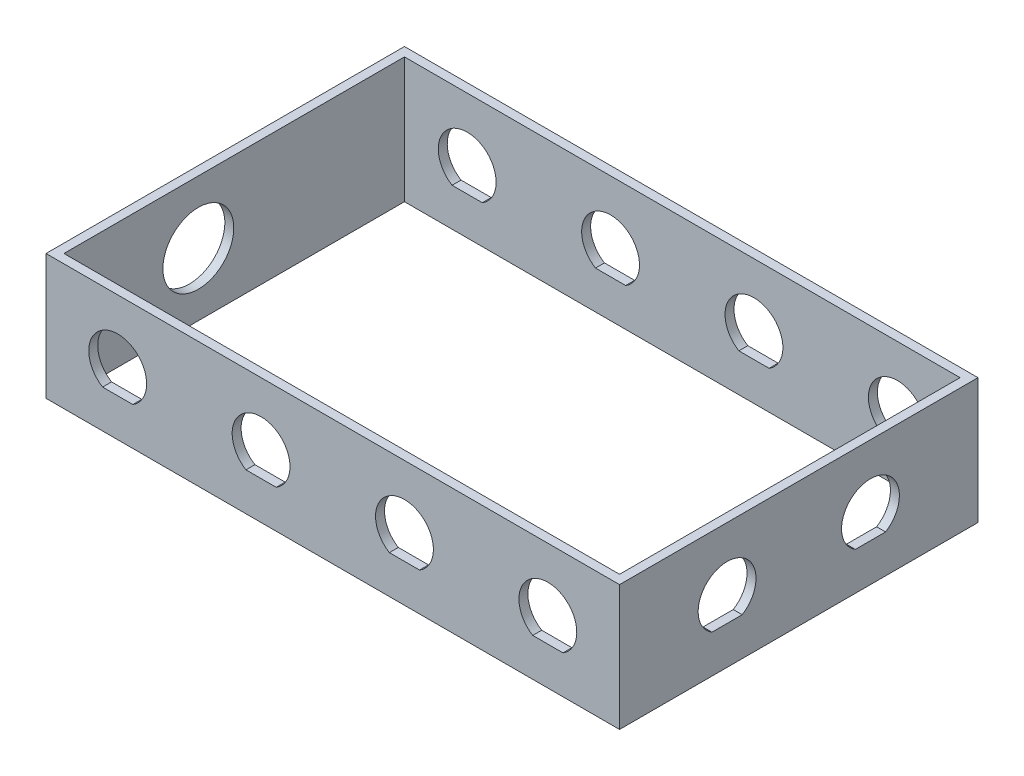
ISO-10303-21;
HEADER;
FILE_DESCRIPTION(('STEP AP214'),'2;1');
FILE_NAME('part.step','',(''),(''),'','','');
FILE_SCHEMA(('AUTOMOTIVE_DESIGN { 1 0 10303 214 1 1 1 1 }'));
ENDSEC;
DATA;
#1=APPLICATION_CONTEXT('core data for automotive mechanical design processes');
#2=APPLICATION_PROTOCOL_DEFINITION('international standard','automotive_design',2000,#1);
#3=PRODUCT_CONTEXT('',#1,'mechanical');
#4=PRODUCT('Part','Part','',(#3));
#5=PRODUCT_RELATED_PRODUCT_CATEGORY('part','',(#4));
#6=PRODUCT_DEFINITION_FORMATION('','',#4);
#7=PRODUCT_DEFINITION_CONTEXT('part definition',#1,'design');
#8=PRODUCT_DEFINITION('design','',#6,#7);
#9=PRODUCT_DEFINITION_SHAPE('','',#8);
#10=(LENGTH_UNIT() NAMED_UNIT(*) SI_UNIT(.MILLI.,.METRE.));
#11=(NAMED_UNIT(*) PLANE_ANGLE_UNIT() SI_UNIT($,.RADIAN.));
#12=(NAMED_UNIT(*) SI_UNIT($,.STERADIAN.) SOLID_ANGLE_UNIT());
#13=UNCERTAINTY_MEASURE_WITH_UNIT(LENGTH_MEASURE(1.E-05),#10,'distance_accuracy_value','');
#14=(GEOMETRIC_REPRESENTATION_CONTEXT(3) GLOBAL_UNCERTAINTY_ASSIGNED_CONTEXT((#13)) GLOBAL_UNIT_ASSIGNED_CONTEXT((#10,
#11,#12)) REPRESENTATION_CONTEXT('',''));
#15=CARTESIAN_POINT('',(0.,0.,0.));
#16=DIRECTION('',(0.,0.,1.));
#17=DIRECTION('',(1.,0.,0.));
#18=AXIS2_PLACEMENT_3D('',#15,#16,#17);
#19=CARTESIAN_POINT('',(-101.6,44.45,63.5));
#20=DIRECTION('',(1.,0.,0.));
#21=DIRECTION('',(0.,0.,-1.));
#22=AXIS2_PLACEMENT_3D('',#19,#20,#21);
#23=PLANE('',#22);
#24=CARTESIAN_POINT('',(-101.6,22.225,12.7));
#25=DIRECTION('',(-1.,0.,0.));
#26=DIRECTION('',(0.,0.,1.));
#27=AXIS2_PLACEMENT_3D('',#24,#25,#26);
#28=CIRCLE('',#27,12.55395);
#29=CARTESIAN_POINT('',(-101.6,22.225,25.25395));
#30=VERTEX_POINT('',#29);
#31=EDGE_CURVE('E234',#30,#30,#28,.T.);
#32=ORIENTED_EDGE('',*,*,#31,.F.);
#33=EDGE_LOOP('',(#32));
#34=FACE_BOUND('',#33,.T.);
#35=DIRECTION('',(0.,-1.,0.));
#36=VECTOR('',#35,1.);
#37=CARTESIAN_POINT('',(-101.6,44.45,-63.5));
#38=LINE('',#37,#36);
#39=CARTESIAN_POINT('',(-101.6,44.45,-63.5));
#40=VERTEX_POINT('',#39);
#41=CARTESIAN_POINT('',(-101.6,0.,-63.5));
#42=VERTEX_POINT('',#41);
#43=EDGE_CURVE('E393',#40,#42,#38,.T.);
#44=ORIENTED_EDGE('',*,*,#43,.T.);
#45=DIRECTION('',(0.,0.,1.));
#46=VECTOR('',#45,1.);
#47=CARTESIAN_POINT('',(-101.6,0.,63.5));
#48=LINE('',#47,#46);
#49=CARTESIAN_POINT('',(-101.6,0.,63.5));
#50=VERTEX_POINT('',#49);
#51=EDGE_CURVE('E377',#42,#50,#48,.T.);
#52=ORIENTED_EDGE('',*,*,#51,.T.);
#53=DIRECTION('',(0.,-1.,0.));
#54=VECTOR('',#53,1.);
#55=CARTESIAN_POINT('',(-101.6,44.45,63.5));
#56=LINE('',#55,#54);
#57=CARTESIAN_POINT('',(-101.6,44.45,63.5));
#58=VERTEX_POINT('',#57);
#59=EDGE_CURVE('E409',#58,#50,#56,.T.);
#60=ORIENTED_EDGE('',*,*,#59,.F.);
#61=DIRECTION('',(0.,0.,1.));
#62=VECTOR('',#61,1.);
#63=CARTESIAN_POINT('',(-101.6,44.45,63.5));
#64=LINE('',#63,#62);
#65=EDGE_CURVE('E383',#40,#58,#64,.T.);
#66=ORIENTED_EDGE('',*,*,#65,.F.);
#67=EDGE_LOOP('',(#44,#52,#60,#66));
#68=FACE_BOUND('',#67,.T.);
#69=ADVANCED_FACE('F33',(#34,#68),#23,.F.);
#70=CARTESIAN_POINT('',(101.6,44.45,63.5));
#71=DIRECTION('',(0.,0.,-1.));
#72=DIRECTION('',(-1.,0.,0.));
#73=AXIS2_PLACEMENT_3D('',#70,#71,#72);
#74=PLANE('',#73);
#75=CARTESIAN_POINT('',(76.2,22.225,63.5));
#76=DIRECTION('',(0.,0.,1.));
#77=DIRECTION('',(1.,0.,0.));
#78=AXIS2_PLACEMENT_3D('',#75,#76,#77);
#79=CIRCLE('',#78,10.2489);
#80=CARTESIAN_POINT('',(81.5567058394129,13.4874,63.5));
#81=VERTEX_POINT('',#80);
#82=CARTESIAN_POINT('',(70.8432941605871,13.4874,63.5));
#83=VERTEX_POINT('',#82);
#84=EDGE_CURVE('E259',#81,#83,#79,.T.);
#85=ORIENTED_EDGE('',*,*,#84,.F.);
#86=DIRECTION('',(1.,0.,0.));
#87=VECTOR('',#86,1.);
#88=CARTESIAN_POINT('',(0.,13.4874,63.5));
#89=LINE('',#88,#87);
#90=EDGE_CURVE('E254',#83,#81,#89,.T.);
#91=ORIENTED_EDGE('',*,*,#90,.F.);
#92=EDGE_LOOP('',(#85,#91));
#93=FACE_BOUND('',#92,.T.);
#94=CARTESIAN_POINT('',(25.4,22.225,63.5));
#95=DIRECTION('',(0.,0.,1.));
#96=DIRECTION('',(1.,0.,0.));
#97=AXIS2_PLACEMENT_3D('',#94,#95,#96);
#98=CIRCLE('',#97,10.2489);
#99=CARTESIAN_POINT('',(30.7567058394129,13.4874,63.5));
#100=VERTEX_POINT('',#99);
#101=CARTESIAN_POINT('',(20.0432941605871,13.4874,63.5));
#102=VERTEX_POINT('',#101);
#103=EDGE_CURVE('E283',#100,#102,#98,.T.);
#104=ORIENTED_EDGE('',*,*,#103,.F.);
#105=DIRECTION('',(1.,0.,0.));
#106=VECTOR('',#105,1.);
#107=CARTESIAN_POINT('',(0.,13.4874,63.5));
#108=LINE('',#107,#106);
#109=EDGE_CURVE('E278',#102,#100,#108,.T.);
#110=ORIENTED_EDGE('',*,*,#109,.F.);
#111=EDGE_LOOP('',(#104,#110));
#112=FACE_BOUND('',#111,.T.);
#113=CARTESIAN_POINT('',(-25.4,22.225,63.5));
#114=DIRECTION('',(0.,0.,1.));
#115=DIRECTION('',(1.,0.,0.));
#116=AXIS2_PLACEMENT_3D('',#113,#114,#115);
#117=CIRCLE('',#116,10.2489);
#118=CARTESIAN_POINT('',(-20.0432941605871,13.4874,63.5));
#119=VERTEX_POINT('',#118);
#120=CARTESIAN_POINT('',(-30.7567058394129,13.4874,63.5));
#121=VERTEX_POINT('',#120);
#122=EDGE_CURVE('E307',#119,#121,#117,.T.);
#123=ORIENTED_EDGE('',*,*,#122,.F.);
#124=DIRECTION('',(1.,0.,0.));
#125=VECTOR('',#124,1.);
#126=CARTESIAN_POINT('',(0.,13.4874,63.5));
#127=LINE('',#126,#125);
#128=EDGE_CURVE('E302',#121,#119,#127,.T.);
#129=ORIENTED_EDGE('',*,*,#128,.F.);
#130=EDGE_LOOP('',(#123,#129));
#131=FACE_BOUND('',#130,.T.);
#132=CARTESIAN_POINT('',(-76.2,22.225,63.5));
#133=DIRECTION('',(0.,0.,1.));
#134=DIRECTION('',(1.,0.,0.));
#135=AXIS2_PLACEMENT_3D('',#132,#133,#134);
#136=CIRCLE('',#135,10.2489);
#137=CARTESIAN_POINT('',(-70.8432941605871,13.4874,63.5));
#138=VERTEX_POINT('',#137);
#139=CARTESIAN_POINT('',(-81.5567058394129,13.4874,63.5));
#140=VERTEX_POINT('',#139);
#141=EDGE_CURVE('E331',#138,#140,#136,.T.);
#142=ORIENTED_EDGE('',*,*,#141,.F.);
#143=DIRECTION('',(1.,0.,0.));
#144=VECTOR('',#143,1.);
#145=CARTESIAN_POINT('',(0.,13.4874,63.5));
#146=LINE('',#145,#144);
#147=EDGE_CURVE('E326',#140,#138,#146,.T.);
#148=ORIENTED_EDGE('',*,*,#147,.F.);
#149=EDGE_LOOP('',(#142,#148));
#150=FACE_BOUND('',#149,.T.);
#151=ORIENTED_EDGE('',*,*,#59,.T.);
#152=DIRECTION('',(1.,0.,0.));
#153=VECTOR('',#152,1.);
#154=CARTESIAN_POINT('',(101.6,0.,63.5));
#155=LINE('',#154,#153);
#156=CARTESIAN_POINT('',(101.6,0.,63.5));
#157=VERTEX_POINT('',#156);
#158=EDGE_CURVE('E396',#50,#157,#155,.T.);
#159=ORIENTED_EDGE('',*,*,#158,.T.);
#160=DIRECTION('',(0.,-1.,0.));
#161=VECTOR('',#160,1.);
#162=CARTESIAN_POINT('',(101.6,44.45,63.5));
#163=LINE('',#162,#161);
#164=CARTESIAN_POINT('',(101.6,44.45,63.5));
#165=VERTEX_POINT('',#164);
#166=EDGE_CURVE('E407',#165,#157,#163,.T.);
#167=ORIENTED_EDGE('',*,*,#166,.F.);
#168=DIRECTION('',(1.,0.,0.));
#169=VECTOR('',#168,1.);
#170=CARTESIAN_POINT('',(101.6,44.45,63.5));
#171=LINE('',#170,#169);
#172=EDGE_CURVE('E386',#58,#165,#171,.T.);
#173=ORIENTED_EDGE('',*,*,#172,.F.);
#174=EDGE_LOOP('',(#151,#159,#167,#173));
#175=FACE_BOUND('',#174,.T.);
#176=ADVANCED_FACE('F442',(#93,#112,#131,#150,#175),#74,.F.);
#177=CARTESIAN_POINT('',(101.6,44.45,63.5));
#178=DIRECTION('',(-1.,0.,0.));
#179=DIRECTION('',(0.,0.,1.));
#180=AXIS2_PLACEMENT_3D('',#177,#178,#179);
#181=PLANE('',#180);
#182=DIRECTION('',(0.,0.,-1.));
#183=VECTOR('',#182,1.);
#184=CARTESIAN_POINT('',(101.6,13.4874,0.));
#185=LINE('',#184,#183);
#186=CARTESIAN_POINT('',(101.6,13.4874,-20.0432941605871));
#187=VERTEX_POINT('',#186);
#188=CARTESIAN_POINT('',(101.6,13.4874,-30.7567058394129));
#189=VERTEX_POINT('',#188);
#190=EDGE_CURVE('E220',#187,#189,#185,.T.);
#191=ORIENTED_EDGE('',*,*,#190,.F.);
#192=CARTESIAN_POINT('',(101.6,22.225,-25.4));
#193=DIRECTION('',(1.,0.,0.));
#194=DIRECTION('',(0.,0.,-1.));
#195=AXIS2_PLACEMENT_3D('',#192,#193,#194);
#196=CIRCLE('',#195,10.2489);
#197=EDGE_CURVE('E47',#189,#187,#196,.T.);
#198=ORIENTED_EDGE('',*,*,#197,.F.);
#199=EDGE_LOOP('',(#191,#198));
#200=FACE_BOUND('',#199,.T.);
#201=DIRECTION('',(0.,0.,-1.));
#202=VECTOR('',#201,1.);
#203=CARTESIAN_POINT('',(101.6,13.4874,0.));
#204=LINE('',#203,#202);
#205=CARTESIAN_POINT('',(101.6,13.4874,30.7567058394129));
#206=VERTEX_POINT('',#205);
#207=CARTESIAN_POINT('',(101.6,13.4874,20.0432941605871));
#208=VERTEX_POINT('',#207);
#209=EDGE_CURVE('E243',#206,#208,#204,.T.);
#210=ORIENTED_EDGE('',*,*,#209,.F.);
#211=CARTESIAN_POINT('',(101.6,22.225,25.4));
#212=DIRECTION('',(1.,0.,0.));
#213=DIRECTION('',(0.,0.,-1.));
#214=AXIS2_PLACEMENT_3D('',#211,#212,#213);
#215=CIRCLE('',#214,10.2489);
#216=EDGE_CURVE('E241',#208,#206,#215,.T.);
#217=ORIENTED_EDGE('',*,*,#216,.F.);
#218=EDGE_LOOP('',(#210,#217));
#219=FACE_BOUND('',#218,.T.);
#220=ORIENTED_EDGE('',*,*,#166,.T.);
#221=DIRECTION('',(0.,0.,-1.));
#222=VECTOR('',#221,1.);
#223=CARTESIAN_POINT('',(101.6,0.,63.5));
#224=LINE('',#223,#222);
#225=CARTESIAN_POINT('',(101.6,0.,-63.5));
#226=VERTEX_POINT('',#225);
#227=EDGE_CURVE('E399',#157,#226,#224,.T.);
#228=ORIENTED_EDGE('',*,*,#227,.T.);
#229=DIRECTION('',(0.,-1.,0.));
#230=VECTOR('',#229,1.);
#231=CARTESIAN_POINT('',(101.6,44.45,-63.5));
#232=LINE('',#231,#230);
#233=CARTESIAN_POINT('',(101.6,44.45,-63.5));
#234=VERTEX_POINT('',#233);
#235=EDGE_CURVE('E405',#234,#226,#232,.T.);
#236=ORIENTED_EDGE('',*,*,#235,.F.);
#237=DIRECTION('',(0.,0.,-1.));
#238=VECTOR('',#237,1.);
#239=CARTESIAN_POINT('',(101.6,44.45,63.5));
#240=LINE('',#239,#238);
#241=EDGE_CURVE('E389',#165,#234,#240,.T.);
#242=ORIENTED_EDGE('',*,*,#241,.F.);
#243=EDGE_LOOP('',(#220,#228,#236,#242));
#244=FACE_BOUND('',#243,.T.);
#245=ADVANCED_FACE('F445',(#200,#219,#244),#181,.F.);
#246=CARTESIAN_POINT('',(101.6,44.45,-63.5));
#247=DIRECTION('',(0.,0.,1.));
#248=DIRECTION('',(1.,0.,0.));
#249=AXIS2_PLACEMENT_3D('',#246,#247,#248);
#250=PLANE('',#249);
#251=CARTESIAN_POINT('',(76.2,22.225,-63.5));
#252=DIRECTION('',(0.,0.,1.));
#253=DIRECTION('',(1.,0.,0.));
#254=AXIS2_PLACEMENT_3D('',#251,#252,#253);
#255=CIRCLE('',#254,10.2489);
#256=CARTESIAN_POINT('',(81.5567058394129,13.4874,-63.5));
#257=VERTEX_POINT('',#256);
#258=CARTESIAN_POINT('',(70.8432941605871,13.4874,-63.5));
#259=VERTEX_POINT('',#258);
#260=EDGE_CURVE('E258',#257,#259,#255,.T.);
#261=ORIENTED_EDGE('',*,*,#260,.T.);
#262=DIRECTION('',(1.,0.,0.));
#263=VECTOR('',#262,1.);
#264=CARTESIAN_POINT('',(0.,13.4874,-63.5));
#265=LINE('',#264,#263);
#266=EDGE_CURVE('E255',#259,#257,#265,.T.);
#267=ORIENTED_EDGE('',*,*,#266,.T.);
#268=EDGE_LOOP('',(#261,#267));
#269=FACE_BOUND('',#268,.T.);
#270=CARTESIAN_POINT('',(25.4,22.225,-63.5));
#271=DIRECTION('',(0.,0.,1.));
#272=DIRECTION('',(1.,0.,0.));
#273=AXIS2_PLACEMENT_3D('',#270,#271,#272);
#274=CIRCLE('',#273,10.2489);
#275=CARTESIAN_POINT('',(30.7567058394129,13.4874,-63.5));
#276=VERTEX_POINT('',#275);
#277=CARTESIAN_POINT('',(20.0432941605871,13.4874,-63.5));
#278=VERTEX_POINT('',#277);
#279=EDGE_CURVE('E282',#276,#278,#274,.T.);
#280=ORIENTED_EDGE('',*,*,#279,.T.);
#281=DIRECTION('',(1.,0.,0.));
#282=VECTOR('',#281,1.);
#283=CARTESIAN_POINT('',(0.,13.4874,-63.5));
#284=LINE('',#283,#282);
#285=EDGE_CURVE('E279',#278,#276,#284,.T.);
#286=ORIENTED_EDGE('',*,*,#285,.T.);
#287=EDGE_LOOP('',(#280,#286));
#288=FACE_BOUND('',#287,.T.);
#289=CARTESIAN_POINT('',(-25.4,22.225,-63.5));
#290=DIRECTION('',(0.,0.,1.));
#291=DIRECTION('',(1.,0.,0.));
#292=AXIS2_PLACEMENT_3D('',#289,#290,#291);
#293=CIRCLE('',#292,10.2489);
#294=CARTESIAN_POINT('',(-20.0432941605871,13.4874,-63.5));
#295=VERTEX_POINT('',#294);
#296=CARTESIAN_POINT('',(-30.7567058394129,13.4874,-63.5));
#297=VERTEX_POINT('',#296);
#298=EDGE_CURVE('E306',#295,#297,#293,.T.);
#299=ORIENTED_EDGE('',*,*,#298,.T.);
#300=DIRECTION('',(1.,0.,0.));
#301=VECTOR('',#300,1.);
#302=CARTESIAN_POINT('',(0.,13.4874,-63.5));
#303=LINE('',#302,#301);
#304=EDGE_CURVE('E303',#297,#295,#303,.T.);
#305=ORIENTED_EDGE('',*,*,#304,.T.);
#306=EDGE_LOOP('',(#299,#305));
#307=FACE_BOUND('',#306,.T.);
#308=CARTESIAN_POINT('',(-76.2,22.225,-63.5));
#309=DIRECTION('',(0.,0.,1.));
#310=DIRECTION('',(1.,0.,0.));
#311=AXIS2_PLACEMENT_3D('',#308,#309,#310);
#312=CIRCLE('',#311,10.2489);
#313=CARTESIAN_POINT('',(-70.8432941605871,13.4874,-63.5));
#314=VERTEX_POINT('',#313);
#315=CARTESIAN_POINT('',(-81.5567058394129,13.4874,-63.5));
#316=VERTEX_POINT('',#315);
#317=EDGE_CURVE('E330',#314,#316,#312,.T.);
#318=ORIENTED_EDGE('',*,*,#317,.T.);
#319=DIRECTION('',(1.,0.,0.));
#320=VECTOR('',#319,1.);
#321=CARTESIAN_POINT('',(0.,13.4874,-63.5));
#322=LINE('',#321,#320);
#323=EDGE_CURVE('E327',#316,#314,#322,.T.);
#324=ORIENTED_EDGE('',*,*,#323,.T.);
#325=EDGE_LOOP('',(#318,#324));
#326=FACE_BOUND('',#325,.T.);
#327=ORIENTED_EDGE('',*,*,#235,.T.);
#328=DIRECTION('',(-1.,0.,0.));
#329=VECTOR('',#328,1.);
#330=CARTESIAN_POINT('',(101.6,0.,-63.5));
#331=LINE('',#330,#329);
#332=EDGE_CURVE('E387',#226,#42,#331,.T.);
#333=ORIENTED_EDGE('',*,*,#332,.T.);
#334=ORIENTED_EDGE('',*,*,#43,.F.);
#335=DIRECTION('',(-1.,0.,0.));
#336=VECTOR('',#335,1.);
#337=CARTESIAN_POINT('',(101.6,44.45,-63.5));
#338=LINE('',#337,#336);
#339=EDGE_CURVE('E391',#234,#40,#338,.T.);
#340=ORIENTED_EDGE('',*,*,#339,.F.);
#341=EDGE_LOOP('',(#327,#333,#334,#340));
#342=FACE_BOUND('',#341,.T.);
#343=ADVANCED_FACE('F468',(#269,#288,#307,#326,#342),#250,.F.);
#344=CARTESIAN_POINT('',(0.,44.45,0.));
#345=DIRECTION('',(0.,1.,0.));
#346=DIRECTION('',(0.,0.,1.));
#347=AXIS2_PLACEMENT_3D('',#344,#345,#346);
#348=PLANE('',#347);
#349=DIRECTION('',(-1.,0.,0.));
#350=VECTOR('',#349,1.);
#351=CARTESIAN_POINT('',(98.425,44.45,-60.325));
#352=LINE('',#351,#350);
#353=CARTESIAN_POINT('',(98.425,44.45,-60.325));
#354=VERTEX_POINT('',#353);
#355=CARTESIAN_POINT('',(-98.425,44.45,-60.325));
#356=VERTEX_POINT('',#355);
#357=EDGE_CURVE('E350',#354,#356,#352,.T.);
#358=ORIENTED_EDGE('',*,*,#357,.F.);
#359=DIRECTION('',(0.,0.,-1.));
#360=VECTOR('',#359,1.);
#361=CARTESIAN_POINT('',(98.425,44.45,60.325));
#362=LINE('',#361,#360);
#363=CARTESIAN_POINT('',(98.425,44.45,60.325));
#364=VERTEX_POINT('',#363);
#365=EDGE_CURVE('E355',#364,#354,#362,.T.);
#366=ORIENTED_EDGE('',*,*,#365,.F.);
#367=DIRECTION('',(1.,0.,0.));
#368=VECTOR('',#367,1.);
#369=CARTESIAN_POINT('',(-98.425,44.45,60.325));
#370=LINE('',#369,#368);
#371=CARTESIAN_POINT('',(-98.425,44.45,60.325));
#372=VERTEX_POINT('',#371);
#373=EDGE_CURVE('E370',#372,#364,#370,.T.);
#374=ORIENTED_EDGE('',*,*,#373,.F.);
#375=DIRECTION('',(0.,0.,1.));
#376=VECTOR('',#375,1.);
#377=CARTESIAN_POINT('',(-98.425,44.45,-60.325));
#378=LINE('',#377,#376);
#379=EDGE_CURVE('E367',#356,#372,#378,.T.);
#380=ORIENTED_EDGE('',*,*,#379,.F.);
#381=EDGE_LOOP('',(#358,#366,#374,#380));
#382=FACE_BOUND('',#381,.T.);
#383=ORIENTED_EDGE('',*,*,#65,.T.);
#384=ORIENTED_EDGE('',*,*,#172,.T.);
#385=ORIENTED_EDGE('',*,*,#241,.T.);
#386=ORIENTED_EDGE('',*,*,#339,.T.);
#387=EDGE_LOOP('',(#383,#384,#385,#386));
#388=FACE_BOUND('',#387,.T.);
#389=ADVANCED_FACE('F473',(#382,#388),#348,.T.);
#390=CARTESIAN_POINT('',(0.,0.,0.));
#391=DIRECTION('',(0.,1.,0.));
#392=DIRECTION('',(0.,0.,1.));
#393=AXIS2_PLACEMENT_3D('',#390,#391,#392);
#394=PLANE('',#393);
#395=DIRECTION('',(0.,0.,-1.));
#396=VECTOR('',#395,1.);
#397=CARTESIAN_POINT('',(98.425,0.,60.325));
#398=LINE('',#397,#396);
#399=CARTESIAN_POINT('',(98.425,0.,60.325));
#400=VERTEX_POINT('',#399);
#401=CARTESIAN_POINT('',(98.425,0.,-60.325));
#402=VERTEX_POINT('',#401);
#403=EDGE_CURVE('E361',#400,#402,#398,.T.);
#404=ORIENTED_EDGE('',*,*,#403,.T.);
#405=DIRECTION('',(-1.,0.,0.));
#406=VECTOR('',#405,1.);
#407=CARTESIAN_POINT('',(98.425,0.,-60.325));
#408=LINE('',#407,#406);
#409=CARTESIAN_POINT('',(-98.425,0.,-60.325));
#410=VERTEX_POINT('',#409);
#411=EDGE_CURVE('E351',#402,#410,#408,.T.);
#412=ORIENTED_EDGE('',*,*,#411,.T.);
#413=DIRECTION('',(0.,0.,1.));
#414=VECTOR('',#413,1.);
#415=CARTESIAN_POINT('',(-98.425,0.,-60.325));
#416=LINE('',#415,#414);
#417=CARTESIAN_POINT('',(-98.425,0.,60.325));
#418=VERTEX_POINT('',#417);
#419=EDGE_CURVE('E354',#410,#418,#416,.T.);
#420=ORIENTED_EDGE('',*,*,#419,.T.);
#421=DIRECTION('',(1.,0.,0.));
#422=VECTOR('',#421,1.);
#423=CARTESIAN_POINT('',(-98.425,0.,60.325));
#424=LINE('',#423,#422);
#425=EDGE_CURVE('E358',#418,#400,#424,.T.);
#426=ORIENTED_EDGE('',*,*,#425,.T.);
#427=EDGE_LOOP('',(#404,#412,#420,#426));
#428=FACE_BOUND('',#427,.T.);
#429=ORIENTED_EDGE('',*,*,#51,.F.);
#430=ORIENTED_EDGE('',*,*,#332,.F.);
#431=ORIENTED_EDGE('',*,*,#227,.F.);
#432=ORIENTED_EDGE('',*,*,#158,.F.);
#433=EDGE_LOOP('',(#429,#430,#431,#432));
#434=FACE_BOUND('',#433,.T.);
#435=ADVANCED_FACE('F463',(#428,#434),#394,.F.);
#436=CARTESIAN_POINT('',(98.425,0.,-60.325));
#437=DIRECTION('',(0.,0.,-1.));
#438=DIRECTION('',(-1.,0.,0.));
#439=AXIS2_PLACEMENT_3D('',#436,#437,#438);
#440=PLANE('',#439);
#441=CARTESIAN_POINT('',(76.2,22.225,-60.325));
#442=DIRECTION('',(0.,0.,-1.));
#443=DIRECTION('',(-1.,0.,0.));
#444=AXIS2_PLACEMENT_3D('',#441,#442,#443);
#445=CIRCLE('',#444,10.2489);
#446=CARTESIAN_POINT('',(70.8432941605871,13.4874,-60.325));
#447=VERTEX_POINT('',#446);
#448=CARTESIAN_POINT('',(81.5567058394129,13.4874,-60.325));
#449=VERTEX_POINT('',#448);
#450=EDGE_CURVE('E269',#447,#449,#445,.T.);
#451=ORIENTED_EDGE('',*,*,#450,.T.);
#452=DIRECTION('',(-1.,0.,0.));
#453=VECTOR('',#452,1.);
#454=CARTESIAN_POINT('',(98.425,13.4874,-60.325));
#455=LINE('',#454,#453);
#456=EDGE_CURVE('E275',#449,#447,#455,.T.);
#457=ORIENTED_EDGE('',*,*,#456,.T.);
#458=EDGE_LOOP('',(#451,#457));
#459=FACE_BOUND('',#458,.T.);
#460=CARTESIAN_POINT('',(25.4,22.225,-60.325));
#461=DIRECTION('',(0.,0.,-1.));
#462=DIRECTION('',(-1.,0.,0.));
#463=AXIS2_PLACEMENT_3D('',#460,#461,#462);
#464=CIRCLE('',#463,10.2489);
#465=CARTESIAN_POINT('',(20.0432941605871,13.4874,-60.325));
#466=VERTEX_POINT('',#465);
#467=CARTESIAN_POINT('',(30.7567058394129,13.4874,-60.325));
#468=VERTEX_POINT('',#467);
#469=EDGE_CURVE('E293',#466,#468,#464,.T.);
#470=ORIENTED_EDGE('',*,*,#469,.T.);
#471=DIRECTION('',(-1.,0.,0.));
#472=VECTOR('',#471,1.);
#473=CARTESIAN_POINT('',(98.425,13.4874,-60.325));
#474=LINE('',#473,#472);
#475=EDGE_CURVE('E299',#468,#466,#474,.T.);
#476=ORIENTED_EDGE('',*,*,#475,.T.);
#477=EDGE_LOOP('',(#470,#476));
#478=FACE_BOUND('',#477,.T.);
#479=CARTESIAN_POINT('',(-25.4,22.225,-60.325));
#480=DIRECTION('',(0.,0.,-1.));
#481=DIRECTION('',(-1.,0.,0.));
#482=AXIS2_PLACEMENT_3D('',#479,#480,#481);
#483=CIRCLE('',#482,10.2489);
#484=CARTESIAN_POINT('',(-30.7567058394129,13.4874,-60.325));
#485=VERTEX_POINT('',#484);
#486=CARTESIAN_POINT('',(-20.0432941605871,13.4874,-60.325));
#487=VERTEX_POINT('',#486);
#488=EDGE_CURVE('E317',#485,#487,#483,.T.);
#489=ORIENTED_EDGE('',*,*,#488,.T.);
#490=DIRECTION('',(-1.,0.,0.));
#491=VECTOR('',#490,1.);
#492=CARTESIAN_POINT('',(98.425,13.4874,-60.325));
#493=LINE('',#492,#491);
#494=EDGE_CURVE('E323',#487,#485,#493,.T.);
#495=ORIENTED_EDGE('',*,*,#494,.T.);
#496=EDGE_LOOP('',(#489,#495));
#497=FACE_BOUND('',#496,.T.);
#498=CARTESIAN_POINT('',(-76.2,22.225,-60.325));
#499=DIRECTION('',(0.,0.,-1.));
#500=DIRECTION('',(-1.,0.,0.));
#501=AXIS2_PLACEMENT_3D('',#498,#499,#500);
#502=CIRCLE('',#501,10.2489);
#503=CARTESIAN_POINT('',(-81.5567058394129,13.4874,-60.325));
#504=VERTEX_POINT('',#503);
#505=CARTESIAN_POINT('',(-70.8432941605871,13.4874,-60.325));
#506=VERTEX_POINT('',#505);
#507=EDGE_CURVE('E341',#504,#506,#502,.T.);
#508=ORIENTED_EDGE('',*,*,#507,.T.);
#509=DIRECTION('',(-1.,0.,0.));
#510=VECTOR('',#509,1.);
#511=CARTESIAN_POINT('',(98.425,13.4874,-60.325));
#512=LINE('',#511,#510);
#513=EDGE_CURVE('E347',#506,#504,#512,.T.);
#514=ORIENTED_EDGE('',*,*,#513,.T.);
#515=EDGE_LOOP('',(#508,#514));
#516=FACE_BOUND('',#515,.T.);
#517=ORIENTED_EDGE('',*,*,#357,.T.);
#518=DIRECTION('',(0.,1.,0.));
#519=VECTOR('',#518,1.);
#520=CARTESIAN_POINT('',(-98.425,0.,-60.325));
#521=LINE('',#520,#519);
#522=EDGE_CURVE('E364',#410,#356,#521,.T.);
#523=ORIENTED_EDGE('',*,*,#522,.F.);
#524=ORIENTED_EDGE('',*,*,#411,.F.);
#525=DIRECTION('',(0.,1.,0.));
#526=VECTOR('',#525,1.);
#527=CARTESIAN_POINT('',(98.425,0.,-60.325));
#528=LINE('',#527,#526);
#529=EDGE_CURVE('E375',#402,#354,#528,.T.);
#530=ORIENTED_EDGE('',*,*,#529,.T.);
#531=EDGE_LOOP('',(#517,#523,#524,#530));
#532=FACE_BOUND('',#531,.T.);
#533=ADVANCED_FACE('F481',(#459,#478,#497,#516,#532),#440,.F.);
#534=CARTESIAN_POINT('',(98.425,0.,60.325));
#535=DIRECTION('',(1.,0.,0.));
#536=DIRECTION('',(0.,0.,-1.));
#537=AXIS2_PLACEMENT_3D('',#534,#535,#536);
#538=PLANE('',#537);
#539=DIRECTION('',(0.,0.,1.));
#540=VECTOR('',#539,1.);
#541=CARTESIAN_POINT('',(98.425,13.4874,0.));
#542=LINE('',#541,#540);
#543=CARTESIAN_POINT('',(98.425,13.4874,-30.7567058394129));
#544=VERTEX_POINT('',#543);
#545=CARTESIAN_POINT('',(98.425,13.4874,-20.0432941605871));
#546=VERTEX_POINT('',#545);
#547=EDGE_CURVE('E223',#544,#546,#542,.T.);
#548=ORIENTED_EDGE('',*,*,#547,.F.);
#549=CARTESIAN_POINT('',(98.425,22.225,-25.4));
#550=DIRECTION('',(1.,0.,0.));
#551=DIRECTION('',(0.,0.,-1.));
#552=AXIS2_PLACEMENT_3D('',#549,#550,#551);
#553=CIRCLE('',#552,10.2489);
#554=EDGE_CURVE('E52',#546,#544,#553,.F.);
#555=ORIENTED_EDGE('',*,*,#554,.F.);
#556=EDGE_LOOP('',(#548,#555));
#557=FACE_BOUND('',#556,.T.);
#558=DIRECTION('',(0.,0.,1.));
#559=VECTOR('',#558,1.);
#560=CARTESIAN_POINT('',(98.425,13.4874,0.));
#561=LINE('',#560,#559);
#562=CARTESIAN_POINT('',(98.425,13.4874,20.0432941605871));
#563=VERTEX_POINT('',#562);
#564=CARTESIAN_POINT('',(98.425,13.4874,30.7567058394129));
#565=VERTEX_POINT('',#564);
#566=EDGE_CURVE('E249',#563,#565,#561,.T.);
#567=ORIENTED_EDGE('',*,*,#566,.F.);
#568=CARTESIAN_POINT('',(98.425,22.225,25.4));
#569=DIRECTION('',(1.,0.,0.));
#570=DIRECTION('',(0.,0.,-1.));
#571=AXIS2_PLACEMENT_3D('',#568,#569,#570);
#572=CIRCLE('',#571,10.2489);
#573=EDGE_CURVE('E226',#565,#563,#572,.F.);
#574=ORIENTED_EDGE('',*,*,#573,.F.);
#575=EDGE_LOOP('',(#567,#574));
#576=FACE_BOUND('',#575,.T.);
#577=ORIENTED_EDGE('',*,*,#365,.T.);
#578=ORIENTED_EDGE('',*,*,#529,.F.);
#579=ORIENTED_EDGE('',*,*,#403,.F.);
#580=DIRECTION('',(0.,1.,0.));
#581=VECTOR('',#580,1.);
#582=CARTESIAN_POINT('',(98.425,0.,60.325));
#583=LINE('',#582,#581);
#584=EDGE_CURVE('E378',#400,#364,#583,.T.);
#585=ORIENTED_EDGE('',*,*,#584,.T.);
#586=EDGE_LOOP('',(#577,#578,#579,#585));
#587=FACE_BOUND('',#586,.T.);
#588=ADVANCED_FACE('F228',(#557,#576,#587),#538,.F.);
#589=CARTESIAN_POINT('',(-98.425,0.,60.325));
#590=DIRECTION('',(0.,0.,1.));
#591=DIRECTION('',(1.,0.,0.));
#592=AXIS2_PLACEMENT_3D('',#589,#590,#591);
#593=PLANE('',#592);
#594=CARTESIAN_POINT('',(76.2,22.225,60.325));
#595=DIRECTION('',(0.,0.,1.));
#596=DIRECTION('',(1.,0.,0.));
#597=AXIS2_PLACEMENT_3D('',#594,#595,#596);
#598=CIRCLE('',#597,10.2489);
#599=CARTESIAN_POINT('',(81.5567058394129,13.4874,60.325));
#600=VERTEX_POINT('',#599);
#601=CARTESIAN_POINT('',(70.8432941605871,13.4874,60.325));
#602=VERTEX_POINT('',#601);
#603=EDGE_CURVE('E40',#600,#602,#598,.T.);
#604=ORIENTED_EDGE('',*,*,#603,.T.);
#605=DIRECTION('',(1.,0.,0.));
#606=VECTOR('',#605,1.);
#607=CARTESIAN_POINT('',(-98.425,13.4874,60.325));
#608=LINE('',#607,#606);
#609=EDGE_CURVE('E11',#602,#600,#608,.T.);
#610=ORIENTED_EDGE('',*,*,#609,.T.);
#611=EDGE_LOOP('',(#604,#610));
#612=FACE_BOUND('',#611,.T.);
#613=CARTESIAN_POINT('',(25.4,22.225,60.325));
#614=DIRECTION('',(0.,0.,1.));
#615=DIRECTION('',(1.,0.,0.));
#616=AXIS2_PLACEMENT_3D('',#613,#614,#615);
#617=CIRCLE('',#616,10.2489);
#618=CARTESIAN_POINT('',(30.7567058394129,13.4874,60.325));
#619=VERTEX_POINT('',#618);
#620=CARTESIAN_POINT('',(20.0432941605871,13.4874,60.325));
#621=VERTEX_POINT('',#620);
#622=EDGE_CURVE('E423',#619,#621,#617,.T.);
#623=ORIENTED_EDGE('',*,*,#622,.T.);
#624=DIRECTION('',(1.,0.,0.));
#625=VECTOR('',#624,1.);
#626=CARTESIAN_POINT('',(-98.425,13.4874,60.325));
#627=LINE('',#626,#625);
#628=EDGE_CURVE('E426',#621,#619,#627,.T.);
#629=ORIENTED_EDGE('',*,*,#628,.T.);
#630=EDGE_LOOP('',(#623,#629));
#631=FACE_BOUND('',#630,.T.);
#632=CARTESIAN_POINT('',(-25.4,22.225,60.325));
#633=DIRECTION('',(0.,0.,1.));
#634=DIRECTION('',(1.,0.,0.));
#635=AXIS2_PLACEMENT_3D('',#632,#633,#634);
#636=CIRCLE('',#635,10.2489);
#637=CARTESIAN_POINT('',(-20.0432941605871,13.4874,60.325));
#638=VERTEX_POINT('',#637);
#639=CARTESIAN_POINT('',(-30.7567058394129,13.4874,60.325));
#640=VERTEX_POINT('',#639);
#641=EDGE_CURVE('E417',#638,#640,#636,.T.);
#642=ORIENTED_EDGE('',*,*,#641,.T.);
#643=DIRECTION('',(1.,0.,0.));
#644=VECTOR('',#643,1.);
#645=CARTESIAN_POINT('',(-98.425,13.4874,60.325));
#646=LINE('',#645,#644);
#647=EDGE_CURVE('E420',#640,#638,#646,.T.);
#648=ORIENTED_EDGE('',*,*,#647,.T.);
#649=EDGE_LOOP('',(#642,#648));
#650=FACE_BOUND('',#649,.T.);
#651=CARTESIAN_POINT('',(-76.2,22.225,60.325));
#652=DIRECTION('',(0.,0.,1.));
#653=DIRECTION('',(1.,0.,0.));
#654=AXIS2_PLACEMENT_3D('',#651,#652,#653);
#655=CIRCLE('',#654,10.2489);
#656=CARTESIAN_POINT('',(-70.8432941605871,13.4874,60.325));
#657=VERTEX_POINT('',#656);
#658=CARTESIAN_POINT('',(-81.5567058394129,13.4874,60.325));
#659=VERTEX_POINT('',#658);
#660=EDGE_CURVE('E411',#657,#659,#655,.T.);
#661=ORIENTED_EDGE('',*,*,#660,.T.);
#662=DIRECTION('',(1.,0.,0.));
#663=VECTOR('',#662,1.);
#664=CARTESIAN_POINT('',(-98.425,13.4874,60.325));
#665=LINE('',#664,#663);
#666=EDGE_CURVE('E414',#659,#657,#665,.T.);
#667=ORIENTED_EDGE('',*,*,#666,.T.);
#668=EDGE_LOOP('',(#661,#667));
#669=FACE_BOUND('',#668,.T.);
#670=ORIENTED_EDGE('',*,*,#373,.T.);
#671=ORIENTED_EDGE('',*,*,#584,.F.);
#672=ORIENTED_EDGE('',*,*,#425,.F.);
#673=DIRECTION('',(0.,1.,0.));
#674=VECTOR('',#673,1.);
#675=CARTESIAN_POINT('',(-98.425,0.,60.325));
#676=LINE('',#675,#674);
#677=EDGE_CURVE('E380',#418,#372,#676,.T.);
#678=ORIENTED_EDGE('',*,*,#677,.T.);
#679=EDGE_LOOP('',(#670,#671,#672,#678));
#680=FACE_BOUND('',#679,.T.);
#681=ADVANCED_FACE('F430',(#612,#631,#650,#669,#680),#593,.F.);
#682=CARTESIAN_POINT('',(-98.425,0.,-60.325));
#683=DIRECTION('',(-1.,0.,0.));
#684=DIRECTION('',(0.,0.,1.));
#685=AXIS2_PLACEMENT_3D('',#682,#683,#684);
#686=PLANE('',#685);
#687=CARTESIAN_POINT('',(-98.425,22.225,12.7));
#688=DIRECTION('',(-1.,0.,0.));
#689=DIRECTION('',(0.,0.,1.));
#690=AXIS2_PLACEMENT_3D('',#687,#688,#689);
#691=CIRCLE('',#690,12.55395);
#692=CARTESIAN_POINT('',(-98.425,22.225,25.25395));
#693=VERTEX_POINT('',#692);
#694=EDGE_CURVE('E230',#693,#693,#691,.F.);
#695=ORIENTED_EDGE('',*,*,#694,.F.);
#696=EDGE_LOOP('',(#695));
#697=FACE_BOUND('',#696,.T.);
#698=ORIENTED_EDGE('',*,*,#379,.T.);
#699=ORIENTED_EDGE('',*,*,#677,.F.);
#700=ORIENTED_EDGE('',*,*,#419,.F.);
#701=ORIENTED_EDGE('',*,*,#522,.T.);
#702=EDGE_LOOP('',(#698,#699,#700,#701));
#703=FACE_BOUND('',#702,.T.);
#704=ADVANCED_FACE('F501',(#697,#703),#686,.F.);
#705=CARTESIAN_POINT('',(-76.2,22.225,-63.5));
#706=DIRECTION('',(0.,0.,1.));
#707=DIRECTION('',(1.,0.,0.));
#708=AXIS2_PLACEMENT_3D('',#705,#706,#707);
#709=CYLINDRICAL_SURFACE('',#708,10.2489);
#710=DIRECTION('',(0.,0.,1.));
#711=VECTOR('',#710,1.);
#712=CARTESIAN_POINT('',(-70.8432941605871,13.4874,-63.5));
#713=LINE('',#712,#711);
#714=EDGE_CURVE('E334',#657,#138,#713,.T.);
#715=ORIENTED_EDGE('',*,*,#714,.T.);
#716=ORIENTED_EDGE('',*,*,#141,.T.);
#717=DIRECTION('',(0.,0.,1.));
#718=VECTOR('',#717,1.);
#719=CARTESIAN_POINT('',(-81.5567058394129,13.4874,-63.5));
#720=LINE('',#719,#718);
#721=EDGE_CURVE('E342',#659,#140,#720,.T.);
#722=ORIENTED_EDGE('',*,*,#721,.F.);
#723=ORIENTED_EDGE('',*,*,#660,.F.);
#724=EDGE_LOOP('',(#715,#716,#722,#723));
#725=FACE_BOUND('',#724,.T.);
#726=ADVANCED_FACE('F504',(#725),#709,.F.);
#727=CARTESIAN_POINT('',(0.,13.4874,-63.5));
#728=DIRECTION('',(0.,-1.,0.));
#729=DIRECTION('',(1.,0.,0.));
#730=AXIS2_PLACEMENT_3D('',#727,#728,#729);
#731=PLANE('',#730);
#732=ORIENTED_EDGE('',*,*,#721,.T.);
#733=ORIENTED_EDGE('',*,*,#147,.T.);
#734=ORIENTED_EDGE('',*,*,#714,.F.);
#735=ORIENTED_EDGE('',*,*,#666,.F.);
#736=EDGE_LOOP('',(#732,#733,#734,#735));
#737=FACE_BOUND('',#736,.T.);
#738=ADVANCED_FACE('F529',(#737),#731,.F.);
#739=EDGE_CURVE('E343',#314,#506,#713,.T.);
#740=ORIENTED_EDGE('',*,*,#739,.F.);
#741=ORIENTED_EDGE('',*,*,#323,.F.);
#742=EDGE_CURVE('E338',#316,#504,#720,.T.);
#743=ORIENTED_EDGE('',*,*,#742,.T.);
#744=ORIENTED_EDGE('',*,*,#513,.F.);
#745=EDGE_LOOP('',(#740,#741,#743,#744));
#746=FACE_BOUND('',#745,.T.);
#747=ADVANCED_FACE('F525',(#746),#731,.F.);
#748=ORIENTED_EDGE('',*,*,#742,.F.);
#749=ORIENTED_EDGE('',*,*,#317,.F.);
#750=ORIENTED_EDGE('',*,*,#739,.T.);
#751=ORIENTED_EDGE('',*,*,#507,.F.);
#752=EDGE_LOOP('',(#748,#749,#750,#751));
#753=FACE_BOUND('',#752,.T.);
#754=ADVANCED_FACE('F528',(#753),#709,.F.);
#755=CARTESIAN_POINT('',(-25.4,22.225,-63.5));
#756=DIRECTION('',(0.,0.,1.));
#757=DIRECTION('',(1.,0.,0.));
#758=AXIS2_PLACEMENT_3D('',#755,#756,#757);
#759=CYLINDRICAL_SURFACE('',#758,10.2489);
#760=DIRECTION('',(0.,0.,1.));
#761=VECTOR('',#760,1.);
#762=CARTESIAN_POINT('',(-20.0432941605871,13.4874,-63.5));
#763=LINE('',#762,#761);
#764=EDGE_CURVE('E310',#638,#119,#763,.T.);
#765=ORIENTED_EDGE('',*,*,#764,.T.);
#766=ORIENTED_EDGE('',*,*,#122,.T.);
#767=DIRECTION('',(0.,0.,1.));
#768=VECTOR('',#767,1.);
#769=CARTESIAN_POINT('',(-30.7567058394129,13.4874,-63.5));
#770=LINE('',#769,#768);
#771=EDGE_CURVE('E318',#640,#121,#770,.T.);
#772=ORIENTED_EDGE('',*,*,#771,.F.);
#773=ORIENTED_EDGE('',*,*,#641,.F.);
#774=EDGE_LOOP('',(#765,#766,#772,#773));
#775=FACE_BOUND('',#774,.T.);
#776=ADVANCED_FACE('F533',(#775),#759,.F.);
#777=CARTESIAN_POINT('',(0.,13.4874,-63.5));
#778=DIRECTION('',(0.,-1.,0.));
#779=DIRECTION('',(1.,0.,0.));
#780=AXIS2_PLACEMENT_3D('',#777,#778,#779);
#781=PLANE('',#780);
#782=ORIENTED_EDGE('',*,*,#771,.T.);
#783=ORIENTED_EDGE('',*,*,#128,.T.);
#784=ORIENTED_EDGE('',*,*,#764,.F.);
#785=ORIENTED_EDGE('',*,*,#647,.F.);
#786=EDGE_LOOP('',(#782,#783,#784,#785));
#787=FACE_BOUND('',#786,.T.);
#788=ADVANCED_FACE('F539',(#787),#781,.F.);
#789=EDGE_CURVE('E319',#295,#487,#763,.T.);
#790=ORIENTED_EDGE('',*,*,#789,.F.);
#791=ORIENTED_EDGE('',*,*,#304,.F.);
#792=EDGE_CURVE('E314',#297,#485,#770,.T.);
#793=ORIENTED_EDGE('',*,*,#792,.T.);
#794=ORIENTED_EDGE('',*,*,#494,.F.);
#795=EDGE_LOOP('',(#790,#791,#793,#794));
#796=FACE_BOUND('',#795,.T.);
#797=ADVANCED_FACE('F535',(#796),#781,.F.);
#798=ORIENTED_EDGE('',*,*,#792,.F.);
#799=ORIENTED_EDGE('',*,*,#298,.F.);
#800=ORIENTED_EDGE('',*,*,#789,.T.);
#801=ORIENTED_EDGE('',*,*,#488,.F.);
#802=EDGE_LOOP('',(#798,#799,#800,#801));
#803=FACE_BOUND('',#802,.T.);
#804=ADVANCED_FACE('F538',(#803),#759,.F.);
#805=CARTESIAN_POINT('',(25.4,22.225,-63.5));
#806=DIRECTION('',(0.,0.,1.));
#807=DIRECTION('',(1.,0.,0.));
#808=AXIS2_PLACEMENT_3D('',#805,#806,#807);
#809=CYLINDRICAL_SURFACE('',#808,10.2489);
#810=DIRECTION('',(0.,0.,1.));
#811=VECTOR('',#810,1.);
#812=CARTESIAN_POINT('',(30.7567058394129,13.4874,-63.5));
#813=LINE('',#812,#811);
#814=EDGE_CURVE('E286',#619,#100,#813,.T.);
#815=ORIENTED_EDGE('',*,*,#814,.T.);
#816=ORIENTED_EDGE('',*,*,#103,.T.);
#817=DIRECTION('',(0.,0.,1.));
#818=VECTOR('',#817,1.);
#819=CARTESIAN_POINT('',(20.0432941605871,13.4874,-63.5));
#820=LINE('',#819,#818);
#821=EDGE_CURVE('E294',#621,#102,#820,.T.);
#822=ORIENTED_EDGE('',*,*,#821,.F.);
#823=ORIENTED_EDGE('',*,*,#622,.F.);
#824=EDGE_LOOP('',(#815,#816,#822,#823));
#825=FACE_BOUND('',#824,.T.);
#826=ADVANCED_FACE('F543',(#825),#809,.F.);
#827=CARTESIAN_POINT('',(0.,13.4874,-63.5));
#828=DIRECTION('',(0.,-1.,0.));
#829=DIRECTION('',(1.,0.,0.));
#830=AXIS2_PLACEMENT_3D('',#827,#828,#829);
#831=PLANE('',#830);
#832=ORIENTED_EDGE('',*,*,#821,.T.);
#833=ORIENTED_EDGE('',*,*,#109,.T.);
#834=ORIENTED_EDGE('',*,*,#814,.F.);
#835=ORIENTED_EDGE('',*,*,#628,.F.);
#836=EDGE_LOOP('',(#832,#833,#834,#835));
#837=FACE_BOUND('',#836,.T.);
#838=ADVANCED_FACE('F549',(#837),#831,.F.);
#839=EDGE_CURVE('E295',#276,#468,#813,.T.);
#840=ORIENTED_EDGE('',*,*,#839,.F.);
#841=ORIENTED_EDGE('',*,*,#285,.F.);
#842=EDGE_CURVE('E290',#278,#466,#820,.T.);
#843=ORIENTED_EDGE('',*,*,#842,.T.);
#844=ORIENTED_EDGE('',*,*,#475,.F.);
#845=EDGE_LOOP('',(#840,#841,#843,#844));
#846=FACE_BOUND('',#845,.T.);
#847=ADVANCED_FACE('F545',(#846),#831,.F.);
#848=ORIENTED_EDGE('',*,*,#842,.F.);
#849=ORIENTED_EDGE('',*,*,#279,.F.);
#850=ORIENTED_EDGE('',*,*,#839,.T.);
#851=ORIENTED_EDGE('',*,*,#469,.F.);
#852=EDGE_LOOP('',(#848,#849,#850,#851));
#853=FACE_BOUND('',#852,.T.);
#854=ADVANCED_FACE('F548',(#853),#809,.F.);
#855=CARTESIAN_POINT('',(76.2,22.225,-63.5));
#856=DIRECTION('',(0.,0.,1.));
#857=DIRECTION('',(1.,0.,0.));
#858=AXIS2_PLACEMENT_3D('',#855,#856,#857);
#859=CYLINDRICAL_SURFACE('',#858,10.2489);
#860=DIRECTION('',(0.,0.,1.));
#861=VECTOR('',#860,1.);
#862=CARTESIAN_POINT('',(81.5567058394129,13.4874,-63.5));
#863=LINE('',#862,#861);
#864=EDGE_CURVE('E262',#600,#81,#863,.T.);
#865=ORIENTED_EDGE('',*,*,#864,.T.);
#866=ORIENTED_EDGE('',*,*,#84,.T.);
#867=DIRECTION('',(0.,0.,1.));
#868=VECTOR('',#867,1.);
#869=CARTESIAN_POINT('',(70.8432941605871,13.4874,-63.5));
#870=LINE('',#869,#868);
#871=EDGE_CURVE('E270',#602,#83,#870,.T.);
#872=ORIENTED_EDGE('',*,*,#871,.F.);
#873=ORIENTED_EDGE('',*,*,#603,.F.);
#874=EDGE_LOOP('',(#865,#866,#872,#873));
#875=FACE_BOUND('',#874,.T.);
#876=ADVANCED_FACE('F436',(#875),#859,.F.);
#877=CARTESIAN_POINT('',(0.,13.4874,-63.5));
#878=DIRECTION('',(0.,-1.,0.));
#879=DIRECTION('',(1.,0.,0.));
#880=AXIS2_PLACEMENT_3D('',#877,#878,#879);
#881=PLANE('',#880);
#882=ORIENTED_EDGE('',*,*,#871,.T.);
#883=ORIENTED_EDGE('',*,*,#90,.T.);
#884=ORIENTED_EDGE('',*,*,#864,.F.);
#885=ORIENTED_EDGE('',*,*,#609,.F.);
#886=EDGE_LOOP('',(#882,#883,#884,#885));
#887=FACE_BOUND('',#886,.T.);
#888=ADVANCED_FACE('F439',(#887),#881,.F.);
#889=EDGE_CURVE('E271',#257,#449,#863,.T.);
#890=ORIENTED_EDGE('',*,*,#889,.F.);
#891=ORIENTED_EDGE('',*,*,#266,.F.);
#892=EDGE_CURVE('E266',#259,#447,#870,.T.);
#893=ORIENTED_EDGE('',*,*,#892,.T.);
#894=ORIENTED_EDGE('',*,*,#456,.F.);
#895=EDGE_LOOP('',(#890,#891,#893,#894));
#896=FACE_BOUND('',#895,.T.);
#897=ADVANCED_FACE('F554',(#896),#881,.F.);
#898=ORIENTED_EDGE('',*,*,#892,.F.);
#899=ORIENTED_EDGE('',*,*,#260,.F.);
#900=ORIENTED_EDGE('',*,*,#889,.T.);
#901=ORIENTED_EDGE('',*,*,#450,.F.);
#902=EDGE_LOOP('',(#898,#899,#900,#901));
#903=FACE_BOUND('',#902,.T.);
#904=ADVANCED_FACE('F557',(#903),#859,.F.);
#905=CARTESIAN_POINT('',(-101.601,22.225,25.4));
#906=DIRECTION('',(1.,0.,0.));
#907=DIRECTION('',(0.,0.,-1.));
#908=AXIS2_PLACEMENT_3D('',#905,#906,#907);
#909=CYLINDRICAL_SURFACE('',#908,10.2489);
#910=ORIENTED_EDGE('',*,*,#573,.T.);
#911=DIRECTION('',(1.,0.,0.));
#912=VECTOR('',#911,1.);
#913=CARTESIAN_POINT('',(-101.601,13.4874,20.0432941605871));
#914=LINE('',#913,#912);
#915=EDGE_CURVE('E247',#563,#208,#914,.T.);
#916=ORIENTED_EDGE('',*,*,#915,.T.);
#917=ORIENTED_EDGE('',*,*,#216,.T.);
#918=DIRECTION('',(1.,0.,0.));
#919=VECTOR('',#918,1.);
#920=CARTESIAN_POINT('',(-101.601,13.4874,30.7567058394129));
#921=LINE('',#920,#919);
#922=EDGE_CURVE('E246',#565,#206,#921,.T.);
#923=ORIENTED_EDGE('',*,*,#922,.F.);
#924=EDGE_LOOP('',(#910,#916,#917,#923));
#925=FACE_BOUND('',#924,.T.);
#926=ADVANCED_FACE('F561',(#925),#909,.F.);
#927=CARTESIAN_POINT('',(-101.601,13.4874,0.));
#928=DIRECTION('',(0.,-1.,0.));
#929=DIRECTION('',(0.,0.,-1.));
#930=AXIS2_PLACEMENT_3D('',#927,#928,#929);
#931=PLANE('',#930);
#932=ORIENTED_EDGE('',*,*,#566,.T.);
#933=ORIENTED_EDGE('',*,*,#922,.T.);
#934=ORIENTED_EDGE('',*,*,#209,.T.);
#935=ORIENTED_EDGE('',*,*,#915,.F.);
#936=EDGE_LOOP('',(#932,#933,#934,#935));
#937=FACE_BOUND('',#936,.T.);
#938=ADVANCED_FACE('F565',(#937),#931,.F.);
#939=CARTESIAN_POINT('',(-101.601,22.225,-25.4));
#940=DIRECTION('',(1.,0.,0.));
#941=DIRECTION('',(0.,0.,-1.));
#942=AXIS2_PLACEMENT_3D('',#939,#940,#941);
#943=CYLINDRICAL_SURFACE('',#942,10.2489);
#944=ORIENTED_EDGE('',*,*,#554,.T.);
#945=DIRECTION('',(1.,0.,0.));
#946=VECTOR('',#945,1.);
#947=CARTESIAN_POINT('',(-101.601,13.4874,-30.7567058394129));
#948=LINE('',#947,#946);
#949=EDGE_CURVE('E219',#544,#189,#948,.T.);
#950=ORIENTED_EDGE('',*,*,#949,.T.);
#951=ORIENTED_EDGE('',*,*,#197,.T.);
#952=DIRECTION('',(1.,0.,0.));
#953=VECTOR('',#952,1.);
#954=CARTESIAN_POINT('',(-101.601,13.4874,-20.0432941605871));
#955=LINE('',#954,#953);
#956=EDGE_CURVE('E213',#546,#187,#955,.T.);
#957=ORIENTED_EDGE('',*,*,#956,.F.);
#958=EDGE_LOOP('',(#944,#950,#951,#957));
#959=FACE_BOUND('',#958,.T.);
#960=ADVANCED_FACE('F215',(#959),#943,.F.);
#961=CARTESIAN_POINT('',(-101.601,13.4874,0.));
#962=DIRECTION('',(0.,-1.,0.));
#963=DIRECTION('',(0.,0.,-1.));
#964=AXIS2_PLACEMENT_3D('',#961,#962,#963);
#965=PLANE('',#964);
#966=ORIENTED_EDGE('',*,*,#547,.T.);
#967=ORIENTED_EDGE('',*,*,#956,.T.);
#968=ORIENTED_EDGE('',*,*,#190,.T.);
#969=ORIENTED_EDGE('',*,*,#949,.F.);
#970=EDGE_LOOP('',(#966,#967,#968,#969));
#971=FACE_BOUND('',#970,.T.);
#972=ADVANCED_FACE('F224',(#971),#965,.F.);
#973=CARTESIAN_POINT('',(101.601,22.225,12.7));
#974=DIRECTION('',(-1.,0.,0.));
#975=DIRECTION('',(0.,0.,1.));
#976=AXIS2_PLACEMENT_3D('',#973,#974,#975);
#977=CYLINDRICAL_SURFACE('',#976,12.55395);
#978=ORIENTED_EDGE('',*,*,#31,.T.);
#979=EDGE_LOOP('',(#978));
#980=FACE_BOUND('',#979,.T.);
#981=ORIENTED_EDGE('',*,*,#694,.T.);
#982=EDGE_LOOP('',(#981));
#983=FACE_BOUND('',#982,.T.);
#984=ADVANCED_FACE('F495',(#980,#983),#977,.F.);
#985=CLOSED_SHELL('',(#69,#176,#245,#343,#389,#435,#533,#588,#681,#704,#726,#738,#747,#754,#776,
#788,#797,#804,#826,#838,#847,#854,#876,#888,#897,#904,#926,#938,#960,#972,#984));
#986=MANIFOLD_SOLID_BREP('B2',#985);
#987=ADVANCED_BREP_SHAPE_REPRESENTATION('',(#18,#986),#14);
#988=SHAPE_DEFINITION_REPRESENTATION(#9,#987);
ENDSEC;
END-ISO-10303-21;
